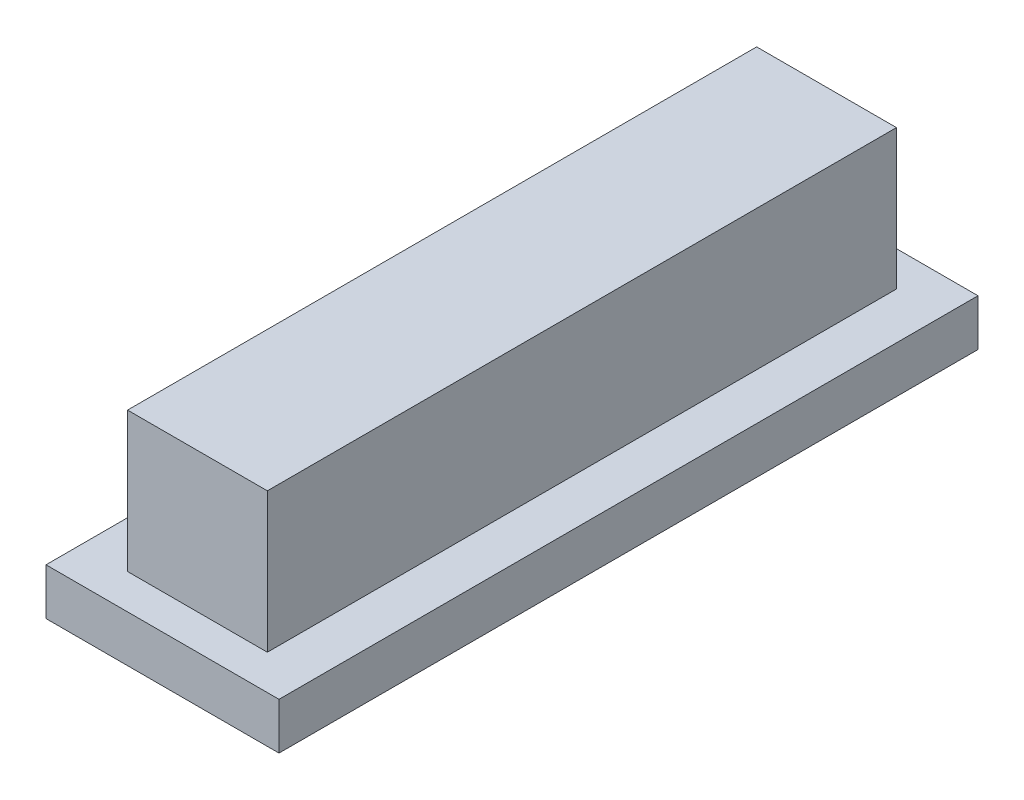
ISO-10303-21;
HEADER;
FILE_DESCRIPTION(('STEP AP214'),'2;1');
FILE_NAME('part.step','',(''),(''),'','','');
FILE_SCHEMA(('AUTOMOTIVE_DESIGN { 1 0 10303 214 1 1 1 1 }'));
ENDSEC;
DATA;
#1=APPLICATION_CONTEXT('core data for automotive mechanical design processes');
#2=APPLICATION_PROTOCOL_DEFINITION('international standard','automotive_design',2000,#1);
#3=PRODUCT_CONTEXT('',#1,'mechanical');
#4=PRODUCT('Part','Part','',(#3));
#5=PRODUCT_RELATED_PRODUCT_CATEGORY('part','',(#4));
#6=PRODUCT_DEFINITION_FORMATION('','',#4);
#7=PRODUCT_DEFINITION_CONTEXT('part definition',#1,'design');
#8=PRODUCT_DEFINITION('design','',#6,#7);
#9=PRODUCT_DEFINITION_SHAPE('','',#8);
#10=(LENGTH_UNIT() NAMED_UNIT(*) SI_UNIT(.MILLI.,.METRE.));
#11=(NAMED_UNIT(*) PLANE_ANGLE_UNIT() SI_UNIT($,.RADIAN.));
#12=(NAMED_UNIT(*) SI_UNIT($,.STERADIAN.) SOLID_ANGLE_UNIT());
#13=UNCERTAINTY_MEASURE_WITH_UNIT(LENGTH_MEASURE(1.E-05),#10,'distance_accuracy_value','');
#14=(GEOMETRIC_REPRESENTATION_CONTEXT(3) GLOBAL_UNCERTAINTY_ASSIGNED_CONTEXT((#13)) GLOBAL_UNIT_ASSIGNED_CONTEXT((#10,
#11,#12)) REPRESENTATION_CONTEXT('',''));
#15=CARTESIAN_POINT('',(0.,0.,0.));
#16=DIRECTION('',(0.,0.,1.));
#17=DIRECTION('',(1.,0.,0.));
#18=AXIS2_PLACEMENT_3D('',#15,#16,#17);
#19=CARTESIAN_POINT('',(3.,4.,13.5));
#20=DIRECTION('',(-1.,0.,0.));
#21=DIRECTION('',(0.,0.,1.));
#22=AXIS2_PLACEMENT_3D('',#19,#20,#21);
#23=PLANE('',#22);
#24=DIRECTION('',(0.,0.,-1.));
#25=VECTOR('',#24,1.);
#26=CARTESIAN_POINT('',(3.,0.,13.5));
#27=LINE('',#26,#25);
#28=CARTESIAN_POINT('',(3.,0.,13.5));
#29=VERTEX_POINT('',#28);
#30=CARTESIAN_POINT('',(3.,0.,-13.5));
#31=VERTEX_POINT('',#30);
#32=EDGE_CURVE('E304',#29,#31,#27,.T.);
#33=ORIENTED_EDGE('',*,*,#32,.T.);
#34=DIRECTION('',(0.,-1.,0.));
#35=VECTOR('',#34,1.);
#36=CARTESIAN_POINT('',(3.,4.,-13.5));
#37=LINE('',#36,#35);
#38=CARTESIAN_POINT('',(3.,6.,-13.5));
#39=VERTEX_POINT('',#38);
#40=EDGE_CURVE('E11',#39,#31,#37,.T.);
#41=ORIENTED_EDGE('',*,*,#40,.F.);
#42=DIRECTION('',(0.,0.,-1.));
#43=VECTOR('',#42,1.);
#44=CARTESIAN_POINT('',(3.,6.,13.5));
#45=LINE('',#44,#43);
#46=CARTESIAN_POINT('',(3.,6.,13.5));
#47=VERTEX_POINT('',#46);
#48=EDGE_CURVE('E252',#47,#39,#45,.T.);
#49=ORIENTED_EDGE('',*,*,#48,.F.);
#50=DIRECTION('',(0.,-1.,0.));
#51=VECTOR('',#50,1.);
#52=CARTESIAN_POINT('',(3.,4.,13.5));
#53=LINE('',#52,#51);
#54=EDGE_CURVE('E317',#47,#29,#53,.T.);
#55=ORIENTED_EDGE('',*,*,#54,.T.);
#56=EDGE_LOOP('',(#33,#41,#49,#55));
#57=FACE_BOUND('',#56,.T.);
#58=ADVANCED_FACE('F39',(#57),#23,.F.);
#59=CARTESIAN_POINT('',(-3.,4.,-13.5));
#60=DIRECTION('',(0.,0.,1.));
#61=DIRECTION('',(1.,0.,0.));
#62=AXIS2_PLACEMENT_3D('',#59,#60,#61);
#63=PLANE('',#62);
#64=DIRECTION('',(-1.,0.,0.));
#65=VECTOR('',#64,1.);
#66=CARTESIAN_POINT('',(-3.,0.,-13.5));
#67=LINE('',#66,#65);
#68=CARTESIAN_POINT('',(-3.,0.,-13.5));
#69=VERTEX_POINT('',#68);
#70=EDGE_CURVE('E308',#31,#69,#67,.T.);
#71=ORIENTED_EDGE('',*,*,#70,.T.);
#72=DIRECTION('',(0.,-1.,0.));
#73=VECTOR('',#72,1.);
#74=CARTESIAN_POINT('',(-3.,4.,-13.5));
#75=LINE('',#74,#73);
#76=CARTESIAN_POINT('',(-3.,6.,-13.5));
#77=VERTEX_POINT('',#76);
#78=EDGE_CURVE('E47',#77,#69,#75,.T.);
#79=ORIENTED_EDGE('',*,*,#78,.F.);
#80=DIRECTION('',(-1.,0.,0.));
#81=VECTOR('',#80,1.);
#82=CARTESIAN_POINT('',(-3.,6.,-13.5));
#83=LINE('',#82,#81);
#84=EDGE_CURVE('E256',#39,#77,#83,.T.);
#85=ORIENTED_EDGE('',*,*,#84,.F.);
#86=ORIENTED_EDGE('',*,*,#40,.T.);
#87=EDGE_LOOP('',(#71,#79,#85,#86));
#88=FACE_BOUND('',#87,.T.);
#89=ADVANCED_FACE('F331',(#88),#63,.F.);
#90=CARTESIAN_POINT('',(-3.,4.,13.5));
#91=DIRECTION('',(1.,0.,0.));
#92=DIRECTION('',(0.,0.,-1.));
#93=AXIS2_PLACEMENT_3D('',#90,#91,#92);
#94=PLANE('',#93);
#95=DIRECTION('',(0.,0.,1.));
#96=VECTOR('',#95,1.);
#97=CARTESIAN_POINT('',(-3.,0.,13.5));
#98=LINE('',#97,#96);
#99=CARTESIAN_POINT('',(-3.,0.,13.5));
#100=VERTEX_POINT('',#99);
#101=EDGE_CURVE('E62',#69,#100,#98,.T.);
#102=ORIENTED_EDGE('',*,*,#101,.T.);
#103=DIRECTION('',(0.,-1.,0.));
#104=VECTOR('',#103,1.);
#105=CARTESIAN_POINT('',(-3.,4.,13.5));
#106=LINE('',#105,#104);
#107=CARTESIAN_POINT('',(-3.,6.,13.5));
#108=VERTEX_POINT('',#107);
#109=EDGE_CURVE('E321',#108,#100,#106,.T.);
#110=ORIENTED_EDGE('',*,*,#109,.F.);
#111=DIRECTION('',(0.,0.,1.));
#112=VECTOR('',#111,1.);
#113=CARTESIAN_POINT('',(-3.,6.,13.5));
#114=LINE('',#113,#112);
#115=EDGE_CURVE('E244',#77,#108,#114,.T.);
#116=ORIENTED_EDGE('',*,*,#115,.F.);
#117=ORIENTED_EDGE('',*,*,#78,.T.);
#118=EDGE_LOOP('',(#102,#110,#116,#117));
#119=FACE_BOUND('',#118,.T.);
#120=ADVANCED_FACE('F328',(#119),#94,.F.);
#121=CARTESIAN_POINT('',(-3.,4.,13.5));
#122=DIRECTION('',(0.,0.,-1.));
#123=DIRECTION('',(-1.,0.,0.));
#124=AXIS2_PLACEMENT_3D('',#121,#122,#123);
#125=PLANE('',#124);
#126=DIRECTION('',(1.,0.,0.));
#127=VECTOR('',#126,1.);
#128=CARTESIAN_POINT('',(-3.,0.,13.5));
#129=LINE('',#128,#127);
#130=EDGE_CURVE('E313',#100,#29,#129,.T.);
#131=ORIENTED_EDGE('',*,*,#130,.T.);
#132=ORIENTED_EDGE('',*,*,#54,.F.);
#133=DIRECTION('',(1.,0.,0.));
#134=VECTOR('',#133,1.);
#135=CARTESIAN_POINT('',(-3.,6.,13.5));
#136=LINE('',#135,#134);
#137=EDGE_CURVE('E248',#108,#47,#136,.T.);
#138=ORIENTED_EDGE('',*,*,#137,.F.);
#139=ORIENTED_EDGE('',*,*,#109,.T.);
#140=EDGE_LOOP('',(#131,#132,#138,#139));
#141=FACE_BOUND('',#140,.T.);
#142=ADVANCED_FACE('F339',(#141),#125,.F.);
#143=CARTESIAN_POINT('',(0.,6.,0.));
#144=DIRECTION('',(0.,-1.,0.));
#145=DIRECTION('',(0.,0.,-1.));
#146=AXIS2_PLACEMENT_3D('',#143,#144,#145);
#147=PLANE('',#146);
#148=ORIENTED_EDGE('',*,*,#115,.T.);
#149=ORIENTED_EDGE('',*,*,#137,.T.);
#150=ORIENTED_EDGE('',*,*,#48,.T.);
#151=ORIENTED_EDGE('',*,*,#84,.T.);
#152=EDGE_LOOP('',(#148,#149,#150,#151));
#153=FACE_BOUND('',#152,.T.);
#154=ADVANCED_FACE('F333',(#153),#147,.F.);
#155=CARTESIAN_POINT('',(0.,0.,0.));
#156=DIRECTION('',(0.,1.,0.));
#157=DIRECTION('',(0.,0.,1.));
#158=AXIS2_PLACEMENT_3D('',#155,#156,#157);
#159=PLANE('',#158);
#160=DIRECTION('',(0.,0.,1.));
#161=VECTOR('',#160,1.);
#162=CARTESIAN_POINT('',(5.,0.,-15.));
#163=LINE('',#162,#161);
#164=CARTESIAN_POINT('',(5.,0.,-15.));
#165=VERTEX_POINT('',#164);
#166=CARTESIAN_POINT('',(5.,0.,15.));
#167=VERTEX_POINT('',#166);
#168=EDGE_CURVE('E197',#165,#167,#163,.T.);
#169=ORIENTED_EDGE('',*,*,#168,.F.);
#170=DIRECTION('',(1.,0.,0.));
#171=VECTOR('',#170,1.);
#172=CARTESIAN_POINT('',(-5.,0.,-15.));
#173=LINE('',#172,#171);
#174=CARTESIAN_POINT('',(-5.,0.,-15.));
#175=VERTEX_POINT('',#174);
#176=EDGE_CURVE('E208',#175,#165,#173,.T.);
#177=ORIENTED_EDGE('',*,*,#176,.F.);
#178=DIRECTION('',(0.,0.,-1.));
#179=VECTOR('',#178,1.);
#180=CARTESIAN_POINT('',(-5.,0.,-15.));
#181=LINE('',#180,#179);
#182=CARTESIAN_POINT('',(-5.,0.,15.));
#183=VERTEX_POINT('',#182);
#184=EDGE_CURVE('E224',#183,#175,#181,.T.);
#185=ORIENTED_EDGE('',*,*,#184,.F.);
#186=DIRECTION('',(-1.,0.,0.));
#187=VECTOR('',#186,1.);
#188=CARTESIAN_POINT('',(-5.,0.,15.));
#189=LINE('',#188,#187);
#190=EDGE_CURVE('E221',#167,#183,#189,.T.);
#191=ORIENTED_EDGE('',*,*,#190,.F.);
#192=EDGE_LOOP('',(#169,#177,#185,#191));
#193=FACE_BOUND('',#192,.T.);
#194=ORIENTED_EDGE('',*,*,#32,.F.);
#195=ORIENTED_EDGE('',*,*,#130,.F.);
#196=ORIENTED_EDGE('',*,*,#101,.F.);
#197=ORIENTED_EDGE('',*,*,#70,.F.);
#198=EDGE_LOOP('',(#194,#195,#196,#197));
#199=FACE_BOUND('',#198,.T.);
#200=ADVANCED_FACE('F337',(#193,#199),#159,.T.);
#201=CARTESIAN_POINT('',(5.,-2.,-15.));
#202=DIRECTION('',(-1.,0.,0.));
#203=DIRECTION('',(0.,0.,1.));
#204=AXIS2_PLACEMENT_3D('',#201,#202,#203);
#205=PLANE('',#204);
#206=ORIENTED_EDGE('',*,*,#168,.T.);
#207=DIRECTION('',(0.,1.,0.));
#208=VECTOR('',#207,1.);
#209=CARTESIAN_POINT('',(5.,-2.,15.));
#210=LINE('',#209,#208);
#211=CARTESIAN_POINT('',(5.,-2.,15.));
#212=VERTEX_POINT('',#211);
#213=EDGE_CURVE('E240',#212,#167,#210,.T.);
#214=ORIENTED_EDGE('',*,*,#213,.F.);
#215=DIRECTION('',(0.,0.,1.));
#216=VECTOR('',#215,1.);
#217=CARTESIAN_POINT('',(5.,-2.,-15.));
#218=LINE('',#217,#216);
#219=CARTESIAN_POINT('',(5.,-2.,-15.));
#220=VERTEX_POINT('',#219);
#221=EDGE_CURVE('E203',#220,#212,#218,.T.);
#222=ORIENTED_EDGE('',*,*,#221,.F.);
#223=DIRECTION('',(0.,1.,0.));
#224=VECTOR('',#223,1.);
#225=CARTESIAN_POINT('',(5.,-2.,-15.));
#226=LINE('',#225,#224);
#227=EDGE_CURVE('E217',#220,#165,#226,.T.);
#228=ORIENTED_EDGE('',*,*,#227,.T.);
#229=EDGE_LOOP('',(#206,#214,#222,#228));
#230=FACE_BOUND('',#229,.T.);
#231=ADVANCED_FACE('F375',(#230),#205,.F.);
#232=CARTESIAN_POINT('',(-5.,-2.,15.));
#233=DIRECTION('',(0.,0.,-1.));
#234=DIRECTION('',(-1.,0.,0.));
#235=AXIS2_PLACEMENT_3D('',#232,#233,#234);
#236=PLANE('',#235);
#237=ORIENTED_EDGE('',*,*,#190,.T.);
#238=DIRECTION('',(0.,1.,0.));
#239=VECTOR('',#238,1.);
#240=CARTESIAN_POINT('',(-5.,-2.,15.));
#241=LINE('',#240,#239);
#242=CARTESIAN_POINT('',(-5.,-2.,15.));
#243=VERTEX_POINT('',#242);
#244=EDGE_CURVE('E236',#243,#183,#241,.T.);
#245=ORIENTED_EDGE('',*,*,#244,.F.);
#246=DIRECTION('',(-1.,0.,0.));
#247=VECTOR('',#246,1.);
#248=CARTESIAN_POINT('',(-5.,-2.,15.));
#249=LINE('',#248,#247);
#250=EDGE_CURVE('E207',#212,#243,#249,.T.);
#251=ORIENTED_EDGE('',*,*,#250,.F.);
#252=ORIENTED_EDGE('',*,*,#213,.T.);
#253=EDGE_LOOP('',(#237,#245,#251,#252));
#254=FACE_BOUND('',#253,.T.);
#255=ADVANCED_FACE('F386',(#254),#236,.F.);
#256=CARTESIAN_POINT('',(-5.,-2.,-15.));
#257=DIRECTION('',(1.,0.,0.));
#258=DIRECTION('',(0.,0.,-1.));
#259=AXIS2_PLACEMENT_3D('',#256,#257,#258);
#260=PLANE('',#259);
#261=ORIENTED_EDGE('',*,*,#184,.T.);
#262=DIRECTION('',(0.,1.,0.));
#263=VECTOR('',#262,1.);
#264=CARTESIAN_POINT('',(-5.,-2.,-15.));
#265=LINE('',#264,#263);
#266=CARTESIAN_POINT('',(-5.,-2.,-15.));
#267=VERTEX_POINT('',#266);
#268=EDGE_CURVE('E232',#267,#175,#265,.T.);
#269=ORIENTED_EDGE('',*,*,#268,.F.);
#270=DIRECTION('',(0.,0.,-1.));
#271=VECTOR('',#270,1.);
#272=CARTESIAN_POINT('',(-5.,-2.,-15.));
#273=LINE('',#272,#271);
#274=EDGE_CURVE('E211',#243,#267,#273,.T.);
#275=ORIENTED_EDGE('',*,*,#274,.F.);
#276=ORIENTED_EDGE('',*,*,#244,.T.);
#277=EDGE_LOOP('',(#261,#269,#275,#276));
#278=FACE_BOUND('',#277,.T.);
#279=ADVANCED_FACE('F396',(#278),#260,.F.);
#280=CARTESIAN_POINT('',(-5.,-2.,-15.));
#281=DIRECTION('',(0.,0.,1.));
#282=DIRECTION('',(1.,0.,0.));
#283=AXIS2_PLACEMENT_3D('',#280,#281,#282);
#284=PLANE('',#283);
#285=ORIENTED_EDGE('',*,*,#176,.T.);
#286=ORIENTED_EDGE('',*,*,#227,.F.);
#287=DIRECTION('',(1.,0.,0.));
#288=VECTOR('',#287,1.);
#289=CARTESIAN_POINT('',(-5.,-2.,-15.));
#290=LINE('',#289,#288);
#291=EDGE_CURVE('E214',#267,#220,#290,.T.);
#292=ORIENTED_EDGE('',*,*,#291,.F.);
#293=ORIENTED_EDGE('',*,*,#268,.T.);
#294=EDGE_LOOP('',(#285,#286,#292,#293));
#295=FACE_BOUND('',#294,.T.);
#296=ADVANCED_FACE('F406',(#295),#284,.F.);
#297=CARTESIAN_POINT('',(0.,-2.,0.));
#298=DIRECTION('',(0.,1.,0.));
#299=DIRECTION('',(0.,0.,1.));
#300=AXIS2_PLACEMENT_3D('',#297,#298,#299);
#301=PLANE('',#300);
#302=DIRECTION('',(1.,0.,0.));
#303=VECTOR('',#302,1.);
#304=CARTESIAN_POINT('',(2.95,-2.,-12.5));
#305=LINE('',#304,#303);
#306=CARTESIAN_POINT('',(-2.95,-2.,-12.5));
#307=VERTEX_POINT('',#306);
#308=CARTESIAN_POINT('',(2.95,-2.,-12.5));
#309=VERTEX_POINT('',#308);
#310=EDGE_CURVE('E188',#307,#309,#305,.T.);
#311=ORIENTED_EDGE('',*,*,#310,.F.);
#312=DIRECTION('',(0.,0.,-1.));
#313=VECTOR('',#312,1.);
#314=CARTESIAN_POINT('',(-2.95,-2.,12.5));
#315=LINE('',#314,#313);
#316=CARTESIAN_POINT('',(-2.95,-2.,12.5));
#317=VERTEX_POINT('',#316);
#318=EDGE_CURVE('E54',#317,#307,#315,.T.);
#319=ORIENTED_EDGE('',*,*,#318,.F.);
#320=DIRECTION('',(-1.,0.,0.));
#321=VECTOR('',#320,1.);
#322=CARTESIAN_POINT('',(2.95,-2.,12.5));
#323=LINE('',#322,#321);
#324=CARTESIAN_POINT('',(2.95,-2.,12.5));
#325=VERTEX_POINT('',#324);
#326=EDGE_CURVE('E175',#325,#317,#323,.T.);
#327=ORIENTED_EDGE('',*,*,#326,.F.);
#328=DIRECTION('',(0.,0.,1.));
#329=VECTOR('',#328,1.);
#330=CARTESIAN_POINT('',(2.95,-2.,12.5));
#331=LINE('',#330,#329);
#332=EDGE_CURVE('E179',#309,#325,#331,.T.);
#333=ORIENTED_EDGE('',*,*,#332,.F.);
#334=EDGE_LOOP('',(#311,#319,#327,#333));
#335=FACE_BOUND('',#334,.T.);
#336=ORIENTED_EDGE('',*,*,#221,.T.);
#337=ORIENTED_EDGE('',*,*,#250,.T.);
#338=ORIENTED_EDGE('',*,*,#274,.T.);
#339=ORIENTED_EDGE('',*,*,#291,.T.);
#340=EDGE_LOOP('',(#336,#337,#338,#339));
#341=FACE_BOUND('',#340,.T.);
#342=ADVANCED_FACE('F416',(#335,#341),#301,.F.);
#343=CARTESIAN_POINT('',(-2.95,0.,12.5));
#344=DIRECTION('',(-1.,0.,0.));
#345=DIRECTION('',(0.,0.,1.));
#346=AXIS2_PLACEMENT_3D('',#343,#344,#345);
#347=PLANE('',#346);
#348=ORIENTED_EDGE('',*,*,#318,.T.);
#349=DIRECTION('',(0.,-1.,0.));
#350=VECTOR('',#349,1.);
#351=CARTESIAN_POINT('',(-2.95,0.,-12.5));
#352=LINE('',#351,#350);
#353=CARTESIAN_POINT('',(-2.95,0.,-12.5));
#354=VERTEX_POINT('',#353);
#355=EDGE_CURVE('E150',#354,#307,#352,.T.);
#356=ORIENTED_EDGE('',*,*,#355,.F.);
#357=DIRECTION('',(0.,0.,-1.));
#358=VECTOR('',#357,1.);
#359=CARTESIAN_POINT('',(-2.95,0.,12.5));
#360=LINE('',#359,#358);
#361=CARTESIAN_POINT('',(-2.95,0.,12.5));
#362=VERTEX_POINT('',#361);
#363=EDGE_CURVE('E154',#362,#354,#360,.T.);
#364=ORIENTED_EDGE('',*,*,#363,.F.);
#365=DIRECTION('',(0.,-1.,0.));
#366=VECTOR('',#365,1.);
#367=CARTESIAN_POINT('',(-2.95,0.,12.5));
#368=LINE('',#367,#366);
#369=EDGE_CURVE('E194',#362,#317,#368,.T.);
#370=ORIENTED_EDGE('',*,*,#369,.T.);
#371=EDGE_LOOP('',(#348,#356,#364,#370));
#372=FACE_BOUND('',#371,.T.);
#373=ADVANCED_FACE('F152',(#372),#347,.F.);
#374=CARTESIAN_POINT('',(2.95,0.,12.5));
#375=DIRECTION('',(0.,0.,1.));
#376=DIRECTION('',(1.,0.,0.));
#377=AXIS2_PLACEMENT_3D('',#374,#375,#376);
#378=PLANE('',#377);
#379=ORIENTED_EDGE('',*,*,#326,.T.);
#380=ORIENTED_EDGE('',*,*,#369,.F.);
#381=DIRECTION('',(-1.,0.,0.));
#382=VECTOR('',#381,1.);
#383=CARTESIAN_POINT('',(2.95,0.,12.5));
#384=LINE('',#383,#382);
#385=CARTESIAN_POINT('',(2.95,0.,12.5));
#386=VERTEX_POINT('',#385);
#387=EDGE_CURVE('E161',#386,#362,#384,.T.);
#388=ORIENTED_EDGE('',*,*,#387,.F.);
#389=DIRECTION('',(0.,-1.,0.));
#390=VECTOR('',#389,1.);
#391=CARTESIAN_POINT('',(2.95,0.,12.5));
#392=LINE('',#391,#390);
#393=EDGE_CURVE('E198',#386,#325,#392,.T.);
#394=ORIENTED_EDGE('',*,*,#393,.T.);
#395=EDGE_LOOP('',(#379,#380,#388,#394));
#396=FACE_BOUND('',#395,.T.);
#397=ADVANCED_FACE('F435',(#396),#378,.F.);
#398=CARTESIAN_POINT('',(2.95,0.,12.5));
#399=DIRECTION('',(1.,0.,0.));
#400=DIRECTION('',(0.,0.,-1.));
#401=AXIS2_PLACEMENT_3D('',#398,#399,#400);
#402=PLANE('',#401);
#403=ORIENTED_EDGE('',*,*,#332,.T.);
#404=ORIENTED_EDGE('',*,*,#393,.F.);
#405=DIRECTION('',(0.,0.,1.));
#406=VECTOR('',#405,1.);
#407=CARTESIAN_POINT('',(2.95,0.,12.5));
#408=LINE('',#407,#406);
#409=CARTESIAN_POINT('',(2.95,0.,-12.5));
#410=VERTEX_POINT('',#409);
#411=EDGE_CURVE('E170',#410,#386,#408,.T.);
#412=ORIENTED_EDGE('',*,*,#411,.F.);
#413=DIRECTION('',(0.,-1.,0.));
#414=VECTOR('',#413,1.);
#415=CARTESIAN_POINT('',(2.95,0.,-12.5));
#416=LINE('',#415,#414);
#417=EDGE_CURVE('E160',#410,#309,#416,.T.);
#418=ORIENTED_EDGE('',*,*,#417,.T.);
#419=EDGE_LOOP('',(#403,#404,#412,#418));
#420=FACE_BOUND('',#419,.T.);
#421=ADVANCED_FACE('F444',(#420),#402,.F.);
#422=CARTESIAN_POINT('',(2.95,0.,-12.5));
#423=DIRECTION('',(0.,0.,-1.));
#424=DIRECTION('',(-1.,0.,0.));
#425=AXIS2_PLACEMENT_3D('',#422,#423,#424);
#426=PLANE('',#425);
#427=ORIENTED_EDGE('',*,*,#310,.T.);
#428=ORIENTED_EDGE('',*,*,#417,.F.);
#429=DIRECTION('',(1.,0.,0.));
#430=VECTOR('',#429,1.);
#431=CARTESIAN_POINT('',(2.95,0.,-12.5));
#432=LINE('',#431,#430);
#433=EDGE_CURVE('E164',#354,#410,#432,.T.);
#434=ORIENTED_EDGE('',*,*,#433,.F.);
#435=ORIENTED_EDGE('',*,*,#355,.T.);
#436=EDGE_LOOP('',(#427,#428,#434,#435));
#437=FACE_BOUND('',#436,.T.);
#438=ADVANCED_FACE('F165',(#437),#426,.F.);
#439=CARTESIAN_POINT('',(0.,0.,0.));
#440=DIRECTION('',(0.,1.,0.));
#441=DIRECTION('',(0.,0.,1.));
#442=AXIS2_PLACEMENT_3D('',#439,#440,#441);
#443=PLANE('',#442);
#444=DIRECTION('',(0.,0.,-1.));
#445=VECTOR('',#444,1.);
#446=CARTESIAN_POINT('',(1.5,0.,11.1));
#447=LINE('',#446,#445);
#448=CARTESIAN_POINT('',(1.5,0.,11.1));
#449=VERTEX_POINT('',#448);
#450=CARTESIAN_POINT('',(1.5,0.,-11.1));
#451=VERTEX_POINT('',#450);
#452=EDGE_CURVE('E284',#449,#451,#447,.T.);
#453=ORIENTED_EDGE('',*,*,#452,.T.);
#454=DIRECTION('',(-1.,0.,0.));
#455=VECTOR('',#454,1.);
#456=CARTESIAN_POINT('',(1.5,0.,-11.1));
#457=LINE('',#456,#455);
#458=CARTESIAN_POINT('',(-1.5,0.,-11.1));
#459=VERTEX_POINT('',#458);
#460=EDGE_CURVE('E266',#451,#459,#457,.T.);
#461=ORIENTED_EDGE('',*,*,#460,.T.);
#462=DIRECTION('',(0.,0.,1.));
#463=VECTOR('',#462,1.);
#464=CARTESIAN_POINT('',(-1.5,0.,11.1));
#465=LINE('',#464,#463);
#466=CARTESIAN_POINT('',(-1.5,0.,11.1));
#467=VERTEX_POINT('',#466);
#468=EDGE_CURVE('E260',#459,#467,#465,.T.);
#469=ORIENTED_EDGE('',*,*,#468,.T.);
#470=DIRECTION('',(1.,0.,0.));
#471=VECTOR('',#470,1.);
#472=CARTESIAN_POINT('',(1.5,0.,11.1));
#473=LINE('',#472,#471);
#474=EDGE_CURVE('E281',#467,#449,#473,.T.);
#475=ORIENTED_EDGE('',*,*,#474,.T.);
#476=EDGE_LOOP('',(#453,#461,#469,#475));
#477=FACE_BOUND('',#476,.T.);
#478=ORIENTED_EDGE('',*,*,#363,.T.);
#479=ORIENTED_EDGE('',*,*,#433,.T.);
#480=ORIENTED_EDGE('',*,*,#411,.T.);
#481=ORIENTED_EDGE('',*,*,#387,.T.);
#482=EDGE_LOOP('',(#478,#479,#480,#481));
#483=FACE_BOUND('',#482,.T.);
#484=ADVANCED_FACE('F172',(#477,#483),#443,.F.);
#485=CARTESIAN_POINT('',(0.,4.,0.));
#486=DIRECTION('',(0.,-1.,0.));
#487=DIRECTION('',(0.,0.,-1.));
#488=AXIS2_PLACEMENT_3D('',#485,#486,#487);
#489=PLANE('',#488);
#490=DIRECTION('',(0.,0.,1.));
#491=VECTOR('',#490,1.);
#492=CARTESIAN_POINT('',(-1.5,4.,11.1));
#493=LINE('',#492,#491);
#494=CARTESIAN_POINT('',(-1.5,4.,-11.1));
#495=VERTEX_POINT('',#494);
#496=CARTESIAN_POINT('',(-1.5,4.,11.1));
#497=VERTEX_POINT('',#496);
#498=EDGE_CURVE('E261',#495,#497,#493,.T.);
#499=ORIENTED_EDGE('',*,*,#498,.F.);
#500=DIRECTION('',(-1.,0.,0.));
#501=VECTOR('',#500,1.);
#502=CARTESIAN_POINT('',(1.5,4.,-11.1));
#503=LINE('',#502,#501);
#504=CARTESIAN_POINT('',(1.5,4.,-11.1));
#505=VERTEX_POINT('',#504);
#506=EDGE_CURVE('E274',#505,#495,#503,.T.);
#507=ORIENTED_EDGE('',*,*,#506,.F.);
#508=DIRECTION('',(0.,0.,-1.));
#509=VECTOR('',#508,1.);
#510=CARTESIAN_POINT('',(1.5,4.,11.1));
#511=LINE('',#510,#509);
#512=CARTESIAN_POINT('',(1.5,4.,11.1));
#513=VERTEX_POINT('',#512);
#514=EDGE_CURVE('E270',#513,#505,#511,.T.);
#515=ORIENTED_EDGE('',*,*,#514,.F.);
#516=DIRECTION('',(1.,0.,0.));
#517=VECTOR('',#516,1.);
#518=CARTESIAN_POINT('',(1.5,4.,11.1));
#519=LINE('',#518,#517);
#520=EDGE_CURVE('E265',#497,#513,#519,.T.);
#521=ORIENTED_EDGE('',*,*,#520,.F.);
#522=EDGE_LOOP('',(#499,#507,#515,#521));
#523=FACE_BOUND('',#522,.T.);
#524=ADVANCED_FACE('F471',(#523),#489,.T.);
#525=CARTESIAN_POINT('',(1.5,4.,11.1));
#526=DIRECTION('',(-1.,0.,0.));
#527=DIRECTION('',(0.,0.,1.));
#528=AXIS2_PLACEMENT_3D('',#525,#526,#527);
#529=PLANE('',#528);
#530=ORIENTED_EDGE('',*,*,#452,.F.);
#531=DIRECTION('',(0.,-1.,0.));
#532=VECTOR('',#531,1.);
#533=CARTESIAN_POINT('',(1.5,4.,11.1));
#534=LINE('',#533,#532);
#535=EDGE_CURVE('E296',#513,#449,#534,.T.);
#536=ORIENTED_EDGE('',*,*,#535,.F.);
#537=ORIENTED_EDGE('',*,*,#514,.T.);
#538=DIRECTION('',(0.,-1.,0.));
#539=VECTOR('',#538,1.);
#540=CARTESIAN_POINT('',(1.5,4.,-11.1));
#541=LINE('',#540,#539);
#542=EDGE_CURVE('E292',#505,#451,#541,.T.);
#543=ORIENTED_EDGE('',*,*,#542,.T.);
#544=EDGE_LOOP('',(#530,#536,#537,#543));
#545=FACE_BOUND('',#544,.T.);
#546=ADVANCED_FACE('F478',(#545),#529,.T.);
#547=CARTESIAN_POINT('',(1.5,4.,11.1));
#548=DIRECTION('',(0.,0.,-1.));
#549=DIRECTION('',(-1.,0.,0.));
#550=AXIS2_PLACEMENT_3D('',#547,#548,#549);
#551=PLANE('',#550);
#552=ORIENTED_EDGE('',*,*,#474,.F.);
#553=DIRECTION('',(0.,-1.,0.));
#554=VECTOR('',#553,1.);
#555=CARTESIAN_POINT('',(-1.5,4.,11.1));
#556=LINE('',#555,#554);
#557=EDGE_CURVE('E300',#497,#467,#556,.T.);
#558=ORIENTED_EDGE('',*,*,#557,.F.);
#559=ORIENTED_EDGE('',*,*,#520,.T.);
#560=ORIENTED_EDGE('',*,*,#535,.T.);
#561=EDGE_LOOP('',(#552,#558,#559,#560));
#562=FACE_BOUND('',#561,.T.);
#563=ADVANCED_FACE('F483',(#562),#551,.T.);
#564=CARTESIAN_POINT('',(-1.5,4.,11.1));
#565=DIRECTION('',(1.,0.,0.));
#566=DIRECTION('',(0.,0.,-1.));
#567=AXIS2_PLACEMENT_3D('',#564,#565,#566);
#568=PLANE('',#567);
#569=ORIENTED_EDGE('',*,*,#468,.F.);
#570=DIRECTION('',(0.,-1.,0.));
#571=VECTOR('',#570,1.);
#572=CARTESIAN_POINT('',(-1.5,4.,-11.1));
#573=LINE('',#572,#571);
#574=EDGE_CURVE('E278',#495,#459,#573,.T.);
#575=ORIENTED_EDGE('',*,*,#574,.F.);
#576=ORIENTED_EDGE('',*,*,#498,.T.);
#577=ORIENTED_EDGE('',*,*,#557,.T.);
#578=EDGE_LOOP('',(#569,#575,#576,#577));
#579=FACE_BOUND('',#578,.T.);
#580=ADVANCED_FACE('F494',(#579),#568,.T.);
#581=CARTESIAN_POINT('',(1.5,4.,-11.1));
#582=DIRECTION('',(0.,0.,1.));
#583=DIRECTION('',(1.,0.,0.));
#584=AXIS2_PLACEMENT_3D('',#581,#582,#583);
#585=PLANE('',#584);
#586=ORIENTED_EDGE('',*,*,#460,.F.);
#587=ORIENTED_EDGE('',*,*,#542,.F.);
#588=ORIENTED_EDGE('',*,*,#506,.T.);
#589=ORIENTED_EDGE('',*,*,#574,.T.);
#590=EDGE_LOOP('',(#586,#587,#588,#589));
#591=FACE_BOUND('',#590,.T.);
#592=ADVANCED_FACE('F504',(#591),#585,.T.);
#593=CLOSED_SHELL('',(#58,#89,#120,#142,#154,#200,#231,#255,#279,#296,#342,#373,#397,#421,#438,
#484,#524,#546,#563,#580,#592));
#594=MANIFOLD_SOLID_BREP('B2',#593);
#595=ADVANCED_BREP_SHAPE_REPRESENTATION('',(#18,#594),#14);
#596=SHAPE_DEFINITION_REPRESENTATION(#9,#595);
ENDSEC;
END-ISO-10303-21;
